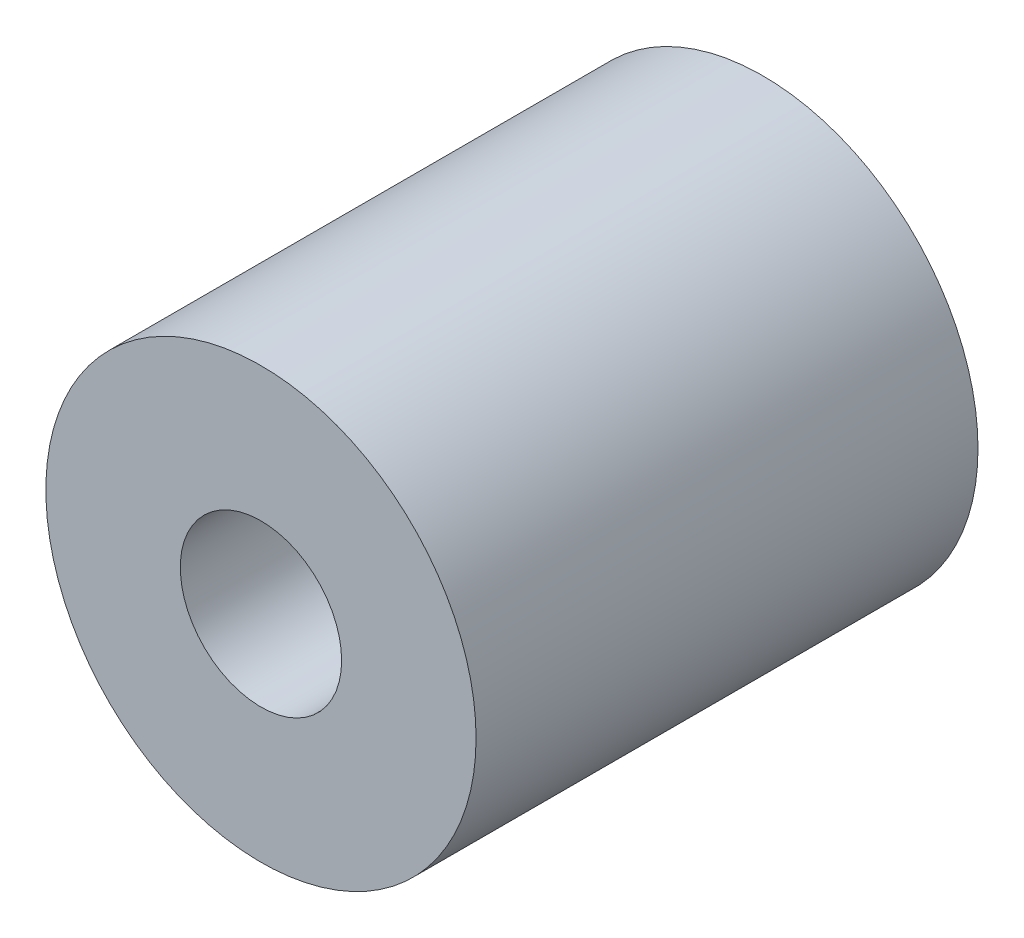
ISO-10303-21;
HEADER;
FILE_DESCRIPTION(('STEP AP214'),'2;1');
FILE_NAME('part.step','',(''),(''),'','','');
FILE_SCHEMA(('AUTOMOTIVE_DESIGN { 1 0 10303 214 1 1 1 1 }'));
ENDSEC;
DATA;
#1=APPLICATION_CONTEXT('core data for automotive mechanical design processes');
#2=APPLICATION_PROTOCOL_DEFINITION('international standard','automotive_design',2000,#1);
#3=PRODUCT_CONTEXT('',#1,'mechanical');
#4=PRODUCT('Part','Part','',(#3));
#5=PRODUCT_RELATED_PRODUCT_CATEGORY('part','',(#4));
#6=PRODUCT_DEFINITION_FORMATION('','',#4);
#7=PRODUCT_DEFINITION_CONTEXT('part definition',#1,'design');
#8=PRODUCT_DEFINITION('design','',#6,#7);
#9=PRODUCT_DEFINITION_SHAPE('','',#8);
#10=(LENGTH_UNIT() NAMED_UNIT(*) SI_UNIT(.MILLI.,.METRE.));
#11=(NAMED_UNIT(*) PLANE_ANGLE_UNIT() SI_UNIT($,.RADIAN.));
#12=(NAMED_UNIT(*) SI_UNIT($,.STERADIAN.) SOLID_ANGLE_UNIT());
#13=UNCERTAINTY_MEASURE_WITH_UNIT(LENGTH_MEASURE(1.E-05),#10,'distance_accuracy_value','');
#14=(GEOMETRIC_REPRESENTATION_CONTEXT(3) GLOBAL_UNCERTAINTY_ASSIGNED_CONTEXT((#13)) GLOBAL_UNIT_ASSIGNED_CONTEXT((#10,
#11,#12)) REPRESENTATION_CONTEXT('',''));
#15=CARTESIAN_POINT('',(0.,0.,0.));
#16=DIRECTION('',(0.,0.,1.));
#17=DIRECTION('',(1.,0.,0.));
#18=AXIS2_PLACEMENT_3D('',#15,#16,#17);
#19=CARTESIAN_POINT('',(0.,0.,11.1125));
#20=DIRECTION('',(0.,0.,1.));
#21=DIRECTION('',(1.,0.,0.));
#22=AXIS2_PLACEMENT_3D('',#19,#20,#21);
#23=PLANE('',#22);
#24=CARTESIAN_POINT('',(0.,0.,11.1125));
#25=DIRECTION('',(0.,0.,1.));
#26=DIRECTION('',(1.,0.,0.));
#27=AXIS2_PLACEMENT_3D('',#24,#25,#26);
#28=CIRCLE('',#27,9.525);
#29=CARTESIAN_POINT('',(9.525,0.,11.1125));
#30=VERTEX_POINT('',#29);
#31=EDGE_CURVE('E10',#30,#30,#28,.T.);
#32=ORIENTED_EDGE('',*,*,#31,.T.);
#33=EDGE_LOOP('',(#32));
#34=FACE_BOUND('',#33,.T.);
#35=CARTESIAN_POINT('',(0.,0.,11.1125));
#36=DIRECTION('',(0.,0.,1.));
#37=DIRECTION('',(1.,0.,0.));
#38=AXIS2_PLACEMENT_3D('',#35,#36,#37);
#39=CIRCLE('',#38,3.571875);
#40=CARTESIAN_POINT('',(3.571875,0.,11.1125));
#41=VERTEX_POINT('',#40);
#42=EDGE_CURVE('E43',#41,#41,#39,.T.);
#43=ORIENTED_EDGE('',*,*,#42,.F.);
#44=EDGE_LOOP('',(#43));
#45=FACE_BOUND('',#44,.T.);
#46=ADVANCED_FACE('F32',(#34,#45),#23,.T.);
#47=CARTESIAN_POINT('',(0.,0.,-11.1125));
#48=DIRECTION('',(0.,0.,1.));
#49=DIRECTION('',(1.,0.,0.));
#50=AXIS2_PLACEMENT_3D('',#47,#48,#49);
#51=PLANE('',#50);
#52=CARTESIAN_POINT('',(0.,0.,-11.1125));
#53=DIRECTION('',(0.,0.,1.));
#54=DIRECTION('',(1.,0.,0.));
#55=AXIS2_PLACEMENT_3D('',#52,#53,#54);
#56=CIRCLE('',#55,9.525);
#57=CARTESIAN_POINT('',(9.525,0.,-11.1125));
#58=VERTEX_POINT('',#57);
#59=EDGE_CURVE('E36',#58,#58,#56,.T.);
#60=ORIENTED_EDGE('',*,*,#59,.F.);
#61=EDGE_LOOP('',(#60));
#62=FACE_BOUND('',#61,.T.);
#63=CARTESIAN_POINT('',(0.,0.,-11.1125));
#64=DIRECTION('',(0.,0.,1.));
#65=DIRECTION('',(1.,0.,0.));
#66=AXIS2_PLACEMENT_3D('',#63,#64,#65);
#67=CIRCLE('',#66,3.571875);
#68=CARTESIAN_POINT('',(3.571875,0.,-11.1125));
#69=VERTEX_POINT('',#68);
#70=EDGE_CURVE('E45',#69,#69,#67,.T.);
#71=ORIENTED_EDGE('',*,*,#70,.T.);
#72=EDGE_LOOP('',(#71));
#73=FACE_BOUND('',#72,.T.);
#74=ADVANCED_FACE('F55',(#62,#73),#51,.F.);
#75=CARTESIAN_POINT('',(0.,0.,11.1125));
#76=DIRECTION('',(0.,0.,-1.));
#77=DIRECTION('',(-1.,0.,0.));
#78=AXIS2_PLACEMENT_3D('',#75,#76,#77);
#79=CYLINDRICAL_SURFACE('',#78,9.525);
#80=ORIENTED_EDGE('',*,*,#31,.F.);
#81=EDGE_LOOP('',(#80));
#82=FACE_BOUND('',#81,.T.);
#83=ORIENTED_EDGE('',*,*,#59,.T.);
#84=EDGE_LOOP('',(#83));
#85=FACE_BOUND('',#84,.T.);
#86=ADVANCED_FACE('F34',(#82,#85),#79,.T.);
#87=CARTESIAN_POINT('',(0.,0.,11.1125));
#88=DIRECTION('',(0.,0.,-1.));
#89=DIRECTION('',(-1.,0.,0.));
#90=AXIS2_PLACEMENT_3D('',#87,#88,#89);
#91=CYLINDRICAL_SURFACE('',#90,3.571875);
#92=ORIENTED_EDGE('',*,*,#42,.T.);
#93=EDGE_LOOP('',(#92));
#94=FACE_BOUND('',#93,.T.);
#95=ORIENTED_EDGE('',*,*,#70,.F.);
#96=EDGE_LOOP('',(#95));
#97=FACE_BOUND('',#96,.T.);
#98=ADVANCED_FACE('F51',(#94,#97),#91,.F.);
#99=CLOSED_SHELL('',(#46,#74,#86,#98));
#100=MANIFOLD_SOLID_BREP('B2',#99);
#101=ADVANCED_BREP_SHAPE_REPRESENTATION('',(#18,#100),#14);
#102=SHAPE_DEFINITION_REPRESENTATION(#9,#101);
ENDSEC;
END-ISO-10303-21;
